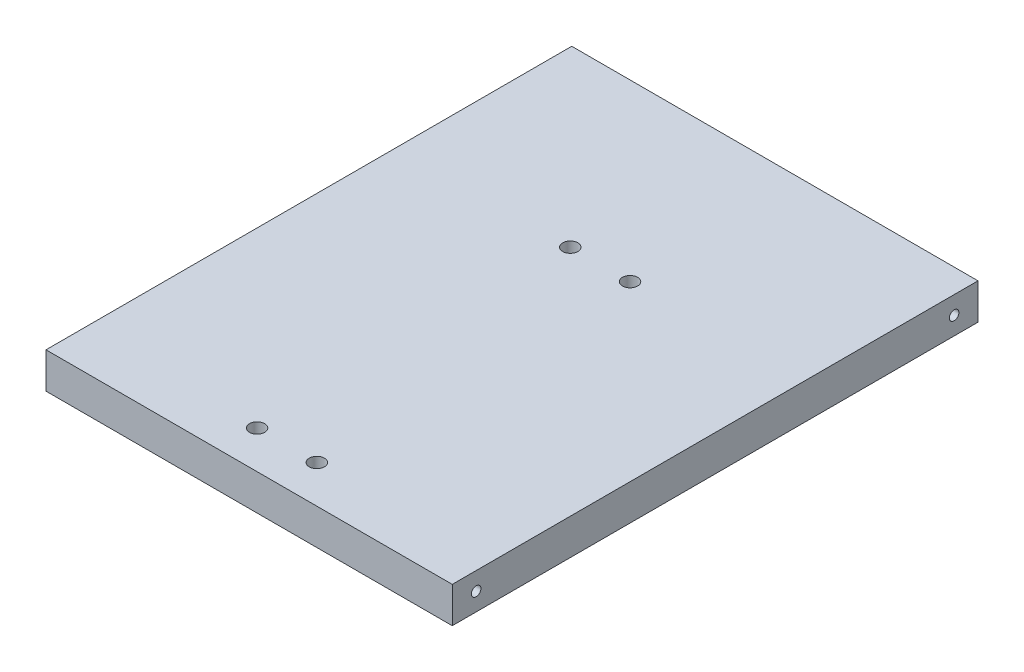
ISO-10303-21;
HEADER;
FILE_DESCRIPTION(('STEP AP214'),'2;1');
FILE_NAME('part.step','',(''),(''),'','','');
FILE_SCHEMA(('AUTOMOTIVE_DESIGN { 1 0 10303 214 1 1 1 1 }'));
ENDSEC;
DATA;
#1=APPLICATION_CONTEXT('core data for automotive mechanical design processes');
#2=APPLICATION_PROTOCOL_DEFINITION('international standard','automotive_design',2000,#1);
#3=PRODUCT_CONTEXT('',#1,'mechanical');
#4=PRODUCT('Part','Part','',(#3));
#5=PRODUCT_RELATED_PRODUCT_CATEGORY('part','',(#4));
#6=PRODUCT_DEFINITION_FORMATION('','',#4);
#7=PRODUCT_DEFINITION_CONTEXT('part definition',#1,'design');
#8=PRODUCT_DEFINITION('design','',#6,#7);
#9=PRODUCT_DEFINITION_SHAPE('','',#8);
#10=(LENGTH_UNIT() NAMED_UNIT(*) SI_UNIT(.MILLI.,.METRE.));
#11=(NAMED_UNIT(*) PLANE_ANGLE_UNIT() SI_UNIT($,.RADIAN.));
#12=(NAMED_UNIT(*) SI_UNIT($,.STERADIAN.) SOLID_ANGLE_UNIT());
#13=UNCERTAINTY_MEASURE_WITH_UNIT(LENGTH_MEASURE(1.E-05),#10,'distance_accuracy_value','');
#14=(GEOMETRIC_REPRESENTATION_CONTEXT(3) GLOBAL_UNCERTAINTY_ASSIGNED_CONTEXT((#13)) GLOBAL_UNIT_ASSIGNED_CONTEXT((#10,
#11,#12)) REPRESENTATION_CONTEXT('',''));
#15=CARTESIAN_POINT('',(0.,0.,0.));
#16=DIRECTION('',(0.,0.,1.));
#17=DIRECTION('',(1.,0.,0.));
#18=AXIS2_PLACEMENT_3D('',#15,#16,#17);
#19=CARTESIAN_POINT('',(0.,15.,0.));
#20=DIRECTION('',(1.,0.,0.));
#21=DIRECTION('',(0.,0.,-1.));
#22=AXIS2_PLACEMENT_3D('',#19,#20,#21);
#23=PLANE('',#22);
#24=CARTESIAN_POINT('',(0.,7.5,-10.));
#25=DIRECTION('',(-1.,0.,0.));
#26=DIRECTION('',(0.,0.,1.));
#27=AXIS2_PLACEMENT_3D('',#24,#25,#26);
#28=CIRCLE('',#27,2.);
#29=CARTESIAN_POINT('',(0.,7.5,-7.99999999999999));
#30=VERTEX_POINT('',#29);
#31=EDGE_CURVE('E117',#30,#30,#28,.T.);
#32=ORIENTED_EDGE('',*,*,#31,.F.);
#33=EDGE_LOOP('',(#32));
#34=FACE_BOUND('',#33,.T.);
#35=CARTESIAN_POINT('',(0.,7.49999999999997,-210.));
#36=DIRECTION('',(-1.,0.,0.));
#37=DIRECTION('',(0.,0.,1.));
#38=AXIS2_PLACEMENT_3D('',#35,#36,#37);
#39=CIRCLE('',#38,2.);
#40=CARTESIAN_POINT('',(0.,7.49999999999997,-208.));
#41=VERTEX_POINT('',#40);
#42=EDGE_CURVE('E110',#41,#41,#39,.T.);
#43=ORIENTED_EDGE('',*,*,#42,.F.);
#44=EDGE_LOOP('',(#43));
#45=FACE_BOUND('',#44,.T.);
#46=DIRECTION('',(0.,0.,1.));
#47=VECTOR('',#46,1.);
#48=CARTESIAN_POINT('',(0.,0.,0.));
#49=LINE('',#48,#47);
#50=CARTESIAN_POINT('',(0.,0.,-220.));
#51=VERTEX_POINT('',#50);
#52=CARTESIAN_POINT('',(0.,0.,0.));
#53=VERTEX_POINT('',#52);
#54=EDGE_CURVE('E96',#51,#53,#49,.T.);
#55=ORIENTED_EDGE('',*,*,#54,.T.);
#56=DIRECTION('',(0.,-1.,0.));
#57=VECTOR('',#56,1.);
#58=CARTESIAN_POINT('',(0.,15.,0.));
#59=LINE('',#58,#57);
#60=CARTESIAN_POINT('',(0.,15.,0.));
#61=VERTEX_POINT('',#60);
#62=EDGE_CURVE('E11',#61,#53,#59,.T.);
#63=ORIENTED_EDGE('',*,*,#62,.F.);
#64=DIRECTION('',(0.,0.,1.));
#65=VECTOR('',#64,1.);
#66=CARTESIAN_POINT('',(0.,15.,0.));
#67=LINE('',#66,#65);
#68=CARTESIAN_POINT('',(0.,15.,-220.));
#69=VERTEX_POINT('',#68);
#70=EDGE_CURVE('E84',#69,#61,#67,.T.);
#71=ORIENTED_EDGE('',*,*,#70,.F.);
#72=DIRECTION('',(0.,-1.,0.));
#73=VECTOR('',#72,1.);
#74=CARTESIAN_POINT('',(0.,15.,-220.));
#75=LINE('',#74,#73);
#76=EDGE_CURVE('E92',#69,#51,#75,.T.);
#77=ORIENTED_EDGE('',*,*,#76,.T.);
#78=EDGE_LOOP('',(#55,#63,#71,#77));
#79=FACE_BOUND('',#78,.T.);
#80=ADVANCED_FACE('F33',(#34,#45,#79),#23,.F.);
#81=CARTESIAN_POINT('',(0.,15.,0.));
#82=DIRECTION('',(0.,0.,-1.));
#83=DIRECTION('',(-1.,0.,0.));
#84=AXIS2_PLACEMENT_3D('',#81,#82,#83);
#85=PLANE('',#84);
#86=DIRECTION('',(1.,0.,0.));
#87=VECTOR('',#86,1.);
#88=CARTESIAN_POINT('',(0.,0.,0.));
#89=LINE('',#88,#87);
#90=CARTESIAN_POINT('',(170.,0.,0.));
#91=VERTEX_POINT('',#90);
#92=EDGE_CURVE('E88',#53,#91,#89,.T.);
#93=ORIENTED_EDGE('',*,*,#92,.T.);
#94=DIRECTION('',(0.,-1.,0.));
#95=VECTOR('',#94,1.);
#96=CARTESIAN_POINT('',(170.,15.,0.));
#97=LINE('',#96,#95);
#98=CARTESIAN_POINT('',(170.,15.,0.));
#99=VERTEX_POINT('',#98);
#100=EDGE_CURVE('E41',#99,#91,#97,.T.);
#101=ORIENTED_EDGE('',*,*,#100,.F.);
#102=DIRECTION('',(1.,0.,0.));
#103=VECTOR('',#102,1.);
#104=CARTESIAN_POINT('',(0.,15.,0.));
#105=LINE('',#104,#103);
#106=EDGE_CURVE('E79',#61,#99,#105,.T.);
#107=ORIENTED_EDGE('',*,*,#106,.F.);
#108=ORIENTED_EDGE('',*,*,#62,.T.);
#109=EDGE_LOOP('',(#93,#101,#107,#108));
#110=FACE_BOUND('',#109,.T.);
#111=ADVANCED_FACE('F87',(#110),#85,.F.);
#112=CARTESIAN_POINT('',(170.,15.,0.));
#113=DIRECTION('',(-1.,0.,0.));
#114=DIRECTION('',(0.,0.,1.));
#115=AXIS2_PLACEMENT_3D('',#112,#113,#114);
#116=PLANE('',#115);
#117=CARTESIAN_POINT('',(170.,7.5,-10.));
#118=DIRECTION('',(-1.,0.,0.));
#119=DIRECTION('',(0.,0.,1.));
#120=AXIS2_PLACEMENT_3D('',#117,#118,#119);
#121=CIRCLE('',#120,2.);
#122=CARTESIAN_POINT('',(170.,7.5,-7.99999999999999));
#123=VERTEX_POINT('',#122);
#124=EDGE_CURVE('E141',#123,#123,#121,.T.);
#125=ORIENTED_EDGE('',*,*,#124,.T.);
#126=EDGE_LOOP('',(#125));
#127=FACE_BOUND('',#126,.T.);
#128=CARTESIAN_POINT('',(170.,7.49999999999997,-210.));
#129=DIRECTION('',(-1.,0.,0.));
#130=DIRECTION('',(0.,0.,1.));
#131=AXIS2_PLACEMENT_3D('',#128,#129,#130);
#132=CIRCLE('',#131,2.);
#133=CARTESIAN_POINT('',(170.,7.49999999999997,-208.));
#134=VERTEX_POINT('',#133);
#135=EDGE_CURVE('E134',#134,#134,#132,.T.);
#136=ORIENTED_EDGE('',*,*,#135,.T.);
#137=EDGE_LOOP('',(#136));
#138=FACE_BOUND('',#137,.T.);
#139=DIRECTION('',(0.,0.,-1.));
#140=VECTOR('',#139,1.);
#141=CARTESIAN_POINT('',(170.,0.,0.));
#142=LINE('',#141,#140);
#143=CARTESIAN_POINT('',(170.,0.,-220.));
#144=VERTEX_POINT('',#143);
#145=EDGE_CURVE('E66',#91,#144,#142,.T.);
#146=ORIENTED_EDGE('',*,*,#145,.T.);
#147=DIRECTION('',(0.,-1.,0.));
#148=VECTOR('',#147,1.);
#149=CARTESIAN_POINT('',(170.,15.,-220.));
#150=LINE('',#149,#148);
#151=CARTESIAN_POINT('',(170.,15.,-220.));
#152=VERTEX_POINT('',#151);
#153=EDGE_CURVE('E89',#152,#144,#150,.T.);
#154=ORIENTED_EDGE('',*,*,#153,.F.);
#155=DIRECTION('',(0.,0.,-1.));
#156=VECTOR('',#155,1.);
#157=CARTESIAN_POINT('',(170.,15.,0.));
#158=LINE('',#157,#156);
#159=EDGE_CURVE('E82',#99,#152,#158,.T.);
#160=ORIENTED_EDGE('',*,*,#159,.F.);
#161=ORIENTED_EDGE('',*,*,#100,.T.);
#162=EDGE_LOOP('',(#146,#154,#160,#161));
#163=FACE_BOUND('',#162,.T.);
#164=ADVANCED_FACE('F90',(#127,#138,#163),#116,.F.);
#165=CARTESIAN_POINT('',(0.,15.,-220.));
#166=DIRECTION('',(0.,0.,1.));
#167=DIRECTION('',(1.,0.,0.));
#168=AXIS2_PLACEMENT_3D('',#165,#166,#167);
#169=PLANE('',#168);
#170=DIRECTION('',(-1.,0.,0.));
#171=VECTOR('',#170,1.);
#172=CARTESIAN_POINT('',(0.,0.,-220.));
#173=LINE('',#172,#171);
#174=EDGE_CURVE('E72',#144,#51,#173,.T.);
#175=ORIENTED_EDGE('',*,*,#174,.T.);
#176=ORIENTED_EDGE('',*,*,#76,.F.);
#177=DIRECTION('',(-1.,0.,0.));
#178=VECTOR('',#177,1.);
#179=CARTESIAN_POINT('',(0.,15.,-220.));
#180=LINE('',#179,#178);
#181=EDGE_CURVE('E49',#152,#69,#180,.T.);
#182=ORIENTED_EDGE('',*,*,#181,.F.);
#183=ORIENTED_EDGE('',*,*,#153,.T.);
#184=EDGE_LOOP('',(#175,#176,#182,#183));
#185=FACE_BOUND('',#184,.T.);
#186=ADVANCED_FACE('F104',(#185),#169,.F.);
#187=CARTESIAN_POINT('',(0.,15.,0.));
#188=DIRECTION('',(0.,-1.,0.));
#189=DIRECTION('',(0.,0.,-1.));
#190=AXIS2_PLACEMENT_3D('',#187,#188,#189);
#191=PLANE('',#190);
#192=CARTESIAN_POINT('',(97.5,15.,-15.821244145017));
#193=DIRECTION('',(0.,-1.,0.));
#194=DIRECTION('',(0.,0.,1.));
#195=AXIS2_PLACEMENT_3D('',#192,#193,#194);
#196=CIRCLE('',#195,3.175);
#197=CARTESIAN_POINT('',(97.5,15.,-12.646244145017));
#198=VERTEX_POINT('',#197);
#199=EDGE_CURVE('E149',#198,#198,#196,.T.);
#200=ORIENTED_EDGE('',*,*,#199,.T.);
#201=EDGE_LOOP('',(#200));
#202=FACE_BOUND('',#201,.T.);
#203=CARTESIAN_POINT('',(97.5,15.,-146.891244145017));
#204=DIRECTION('',(0.,-1.,0.));
#205=DIRECTION('',(0.,0.,1.));
#206=AXIS2_PLACEMENT_3D('',#203,#204,#205);
#207=CIRCLE('',#206,3.175);
#208=CARTESIAN_POINT('',(97.5,15.,-143.716244145017));
#209=VERTEX_POINT('',#208);
#210=EDGE_CURVE('E150',#209,#209,#207,.T.);
#211=ORIENTED_EDGE('',*,*,#210,.T.);
#212=EDGE_LOOP('',(#211));
#213=FACE_BOUND('',#212,.T.);
#214=CARTESIAN_POINT('',(72.5,15.,-15.821244145017));
#215=DIRECTION('',(0.,1.,0.));
#216=DIRECTION('',(0.,0.,1.));
#217=AXIS2_PLACEMENT_3D('',#214,#215,#216);
#218=CIRCLE('',#217,3.175);
#219=CARTESIAN_POINT('',(72.5,15.,-12.646244145017));
#220=VERTEX_POINT('',#219);
#221=EDGE_CURVE('E125',#220,#220,#218,.T.);
#222=ORIENTED_EDGE('',*,*,#221,.F.);
#223=EDGE_LOOP('',(#222));
#224=FACE_BOUND('',#223,.T.);
#225=CARTESIAN_POINT('',(72.5,15.,-146.891244145017));
#226=DIRECTION('',(0.,1.,0.));
#227=DIRECTION('',(0.,0.,1.));
#228=AXIS2_PLACEMENT_3D('',#225,#226,#227);
#229=CIRCLE('',#228,3.175);
#230=CARTESIAN_POINT('',(72.5,15.,-143.716244145017));
#231=VERTEX_POINT('',#230);
#232=EDGE_CURVE('E126',#231,#231,#229,.T.);
#233=ORIENTED_EDGE('',*,*,#232,.F.);
#234=EDGE_LOOP('',(#233));
#235=FACE_BOUND('',#234,.T.);
#236=ORIENTED_EDGE('',*,*,#70,.T.);
#237=ORIENTED_EDGE('',*,*,#106,.T.);
#238=ORIENTED_EDGE('',*,*,#159,.T.);
#239=ORIENTED_EDGE('',*,*,#181,.T.);
#240=EDGE_LOOP('',(#236,#237,#238,#239));
#241=FACE_BOUND('',#240,.T.);
#242=ADVANCED_FACE('F80',(#202,#213,#224,#235,#241),#191,.F.);
#243=CARTESIAN_POINT('',(0.,0.,0.));
#244=DIRECTION('',(0.,-1.,0.));
#245=DIRECTION('',(0.,0.,-1.));
#246=AXIS2_PLACEMENT_3D('',#243,#244,#245);
#247=PLANE('',#246);
#248=CARTESIAN_POINT('',(97.5,0.,-15.821244145017));
#249=DIRECTION('',(0.,-1.,0.));
#250=DIRECTION('',(0.,0.,-1.));
#251=AXIS2_PLACEMENT_3D('',#248,#249,#250);
#252=CIRCLE('',#251,3.175);
#253=CARTESIAN_POINT('',(97.5,0.,-18.996244145017));
#254=VERTEX_POINT('',#253);
#255=EDGE_CURVE('E138',#254,#254,#252,.T.);
#256=ORIENTED_EDGE('',*,*,#255,.F.);
#257=EDGE_LOOP('',(#256));
#258=FACE_BOUND('',#257,.T.);
#259=CARTESIAN_POINT('',(97.5,0.,-146.891244145017));
#260=DIRECTION('',(0.,-1.,0.));
#261=DIRECTION('',(0.,0.,-1.));
#262=AXIS2_PLACEMENT_3D('',#259,#260,#261);
#263=CIRCLE('',#262,3.175);
#264=CARTESIAN_POINT('',(97.5,0.,-150.066244145017));
#265=VERTEX_POINT('',#264);
#266=EDGE_CURVE('E146',#265,#265,#263,.T.);
#267=ORIENTED_EDGE('',*,*,#266,.F.);
#268=EDGE_LOOP('',(#267));
#269=FACE_BOUND('',#268,.T.);
#270=CARTESIAN_POINT('',(72.5,0.,-15.821244145017));
#271=DIRECTION('',(0.,-1.,0.));
#272=DIRECTION('',(0.,0.,-1.));
#273=AXIS2_PLACEMENT_3D('',#270,#271,#272);
#274=CIRCLE('',#273,3.175);
#275=CARTESIAN_POINT('',(72.5,0.,-18.996244145017));
#276=VERTEX_POINT('',#275);
#277=EDGE_CURVE('E114',#276,#276,#274,.F.);
#278=ORIENTED_EDGE('',*,*,#277,.T.);
#279=EDGE_LOOP('',(#278));
#280=FACE_BOUND('',#279,.T.);
#281=CARTESIAN_POINT('',(72.5,0.,-146.891244145017));
#282=DIRECTION('',(0.,-1.,0.));
#283=DIRECTION('',(0.,0.,-1.));
#284=AXIS2_PLACEMENT_3D('',#281,#282,#283);
#285=CIRCLE('',#284,3.175);
#286=CARTESIAN_POINT('',(72.5,0.,-150.066244145017));
#287=VERTEX_POINT('',#286);
#288=EDGE_CURVE('E122',#287,#287,#285,.F.);
#289=ORIENTED_EDGE('',*,*,#288,.T.);
#290=EDGE_LOOP('',(#289));
#291=FACE_BOUND('',#290,.T.);
#292=ORIENTED_EDGE('',*,*,#54,.F.);
#293=ORIENTED_EDGE('',*,*,#174,.F.);
#294=ORIENTED_EDGE('',*,*,#145,.F.);
#295=ORIENTED_EDGE('',*,*,#92,.F.);
#296=EDGE_LOOP('',(#292,#293,#294,#295));
#297=FACE_BOUND('',#296,.T.);
#298=ADVANCED_FACE('F107',(#258,#269,#280,#291,#297),#247,.T.);
#299=CARTESIAN_POINT('',(20.,7.49999999999997,-210.));
#300=DIRECTION('',(-1.,0.,0.));
#301=DIRECTION('',(0.,0.,1.));
#302=AXIS2_PLACEMENT_3D('',#299,#300,#301);
#303=CYLINDRICAL_SURFACE('',#302,2.);
#304=CARTESIAN_POINT('',(20.,7.49999999999997,-210.));
#305=DIRECTION('',(-1.,0.,0.));
#306=DIRECTION('',(0.,0.,1.));
#307=AXIS2_PLACEMENT_3D('',#304,#305,#306);
#308=CIRCLE('',#307,2.);
#309=CARTESIAN_POINT('',(20.,7.49999999999997,-208.));
#310=VERTEX_POINT('',#309);
#311=EDGE_CURVE('E113',#310,#310,#308,.T.);
#312=ORIENTED_EDGE('',*,*,#311,.F.);
#313=EDGE_LOOP('',(#312));
#314=FACE_BOUND('',#313,.T.);
#315=ORIENTED_EDGE('',*,*,#42,.T.);
#316=EDGE_LOOP('',(#315));
#317=FACE_BOUND('',#316,.T.);
#318=ADVANCED_FACE('F169',(#314,#317),#303,.F.);
#319=CARTESIAN_POINT('',(20.,7.49999999999997,-210.));
#320=DIRECTION('',(-1.,0.,0.));
#321=DIRECTION('',(0.,0.,1.));
#322=AXIS2_PLACEMENT_3D('',#319,#320,#321);
#323=PLANE('',#322);
#324=ORIENTED_EDGE('',*,*,#311,.T.);
#325=EDGE_LOOP('',(#324));
#326=FACE_BOUND('',#325,.T.);
#327=ADVANCED_FACE('F203',(#326),#323,.T.);
#328=CARTESIAN_POINT('',(20.,7.5,-10.));
#329=DIRECTION('',(-1.,0.,0.));
#330=DIRECTION('',(0.,0.,1.));
#331=AXIS2_PLACEMENT_3D('',#328,#329,#330);
#332=CYLINDRICAL_SURFACE('',#331,2.);
#333=CARTESIAN_POINT('',(20.,7.5,-10.));
#334=DIRECTION('',(-1.,0.,0.));
#335=DIRECTION('',(0.,0.,1.));
#336=AXIS2_PLACEMENT_3D('',#333,#334,#335);
#337=CIRCLE('',#336,2.);
#338=CARTESIAN_POINT('',(20.,7.5,-7.99999999999999));
#339=VERTEX_POINT('',#338);
#340=EDGE_CURVE('E99',#339,#339,#337,.T.);
#341=ORIENTED_EDGE('',*,*,#340,.F.);
#342=EDGE_LOOP('',(#341));
#343=FACE_BOUND('',#342,.T.);
#344=ORIENTED_EDGE('',*,*,#31,.T.);
#345=EDGE_LOOP('',(#344));
#346=FACE_BOUND('',#345,.T.);
#347=ADVANCED_FACE('F190',(#343,#346),#332,.F.);
#348=CARTESIAN_POINT('',(20.,7.5,-10.));
#349=DIRECTION('',(-1.,0.,0.));
#350=DIRECTION('',(0.,0.,1.));
#351=AXIS2_PLACEMENT_3D('',#348,#349,#350);
#352=PLANE('',#351);
#353=ORIENTED_EDGE('',*,*,#340,.T.);
#354=EDGE_LOOP('',(#353));
#355=FACE_BOUND('',#354,.T.);
#356=ADVANCED_FACE('F180',(#355),#352,.T.);
#357=CARTESIAN_POINT('',(72.5,-8.98025612106917,-146.891244145017));
#358=DIRECTION('',(0.,1.,0.));
#359=DIRECTION('',(0.,0.,1.));
#360=AXIS2_PLACEMENT_3D('',#357,#358,#359);
#361=CYLINDRICAL_SURFACE('',#360,3.175);
#362=ORIENTED_EDGE('',*,*,#232,.T.);
#363=EDGE_LOOP('',(#362));
#364=FACE_BOUND('',#363,.T.);
#365=ORIENTED_EDGE('',*,*,#288,.F.);
#366=EDGE_LOOP('',(#365));
#367=FACE_BOUND('',#366,.T.);
#368=ADVANCED_FACE('F177',(#364,#367),#361,.F.);
#369=CARTESIAN_POINT('',(72.5,-8.98025612106917,-15.821244145017));
#370=DIRECTION('',(0.,1.,0.));
#371=DIRECTION('',(0.,0.,1.));
#372=AXIS2_PLACEMENT_3D('',#369,#370,#371);
#373=CYLINDRICAL_SURFACE('',#372,3.175);
#374=ORIENTED_EDGE('',*,*,#221,.T.);
#375=EDGE_LOOP('',(#374));
#376=FACE_BOUND('',#375,.T.);
#377=ORIENTED_EDGE('',*,*,#277,.F.);
#378=EDGE_LOOP('',(#377));
#379=FACE_BOUND('',#378,.T.);
#380=ADVANCED_FACE('F179',(#376,#379),#373,.F.);
#381=CARTESIAN_POINT('',(150.,7.49999999999997,-210.));
#382=DIRECTION('',(1.,0.,0.));
#383=DIRECTION('',(0.,0.,-1.));
#384=AXIS2_PLACEMENT_3D('',#381,#382,#383);
#385=CYLINDRICAL_SURFACE('',#384,2.);
#386=CARTESIAN_POINT('',(150.,7.49999999999997,-210.));
#387=DIRECTION('',(-1.,0.,0.));
#388=DIRECTION('',(0.,0.,1.));
#389=AXIS2_PLACEMENT_3D('',#386,#387,#388);
#390=CIRCLE('',#389,2.);
#391=CARTESIAN_POINT('',(150.,7.49999999999997,-208.));
#392=VERTEX_POINT('',#391);
#393=EDGE_CURVE('E137',#392,#392,#390,.T.);
#394=ORIENTED_EDGE('',*,*,#393,.T.);
#395=EDGE_LOOP('',(#394));
#396=FACE_BOUND('',#395,.T.);
#397=ORIENTED_EDGE('',*,*,#135,.F.);
#398=EDGE_LOOP('',(#397));
#399=FACE_BOUND('',#398,.T.);
#400=ADVANCED_FACE('F187',(#396,#399),#385,.F.);
#401=CARTESIAN_POINT('',(150.,7.49999999999997,-210.));
#402=DIRECTION('',(1.,0.,0.));
#403=DIRECTION('',(0.,0.,1.));
#404=AXIS2_PLACEMENT_3D('',#401,#402,#403);
#405=PLANE('',#404);
#406=ORIENTED_EDGE('',*,*,#393,.F.);
#407=EDGE_LOOP('',(#406));
#408=FACE_BOUND('',#407,.T.);
#409=ADVANCED_FACE('F227',(#408),#405,.T.);
#410=CARTESIAN_POINT('',(150.,7.5,-10.));
#411=DIRECTION('',(1.,0.,0.));
#412=DIRECTION('',(0.,0.,-1.));
#413=AXIS2_PLACEMENT_3D('',#410,#411,#412);
#414=CYLINDRICAL_SURFACE('',#413,2.);
#415=CARTESIAN_POINT('',(150.,7.5,-10.));
#416=DIRECTION('',(-1.,0.,0.));
#417=DIRECTION('',(0.,0.,1.));
#418=AXIS2_PLACEMENT_3D('',#415,#416,#417);
#419=CIRCLE('',#418,2.);
#420=CARTESIAN_POINT('',(150.,7.5,-7.99999999999999));
#421=VERTEX_POINT('',#420);
#422=EDGE_CURVE('E129',#421,#421,#419,.T.);
#423=ORIENTED_EDGE('',*,*,#422,.T.);
#424=EDGE_LOOP('',(#423));
#425=FACE_BOUND('',#424,.T.);
#426=ORIENTED_EDGE('',*,*,#124,.F.);
#427=EDGE_LOOP('',(#426));
#428=FACE_BOUND('',#427,.T.);
#429=ADVANCED_FACE('F233',(#425,#428),#414,.F.);
#430=CARTESIAN_POINT('',(150.,7.5,-10.));
#431=DIRECTION('',(1.,0.,0.));
#432=DIRECTION('',(0.,0.,1.));
#433=AXIS2_PLACEMENT_3D('',#430,#431,#432);
#434=PLANE('',#433);
#435=ORIENTED_EDGE('',*,*,#422,.F.);
#436=EDGE_LOOP('',(#435));
#437=FACE_BOUND('',#436,.T.);
#438=ADVANCED_FACE('F239',(#437),#434,.T.);
#439=CARTESIAN_POINT('',(97.5,-8.98025612106917,-146.891244145017));
#440=DIRECTION('',(0.,1.,0.));
#441=DIRECTION('',(0.,0.,1.));
#442=AXIS2_PLACEMENT_3D('',#439,#440,#441);
#443=CYLINDRICAL_SURFACE('',#442,3.175);
#444=ORIENTED_EDGE('',*,*,#210,.F.);
#445=EDGE_LOOP('',(#444));
#446=FACE_BOUND('',#445,.T.);
#447=ORIENTED_EDGE('',*,*,#266,.T.);
#448=EDGE_LOOP('',(#447));
#449=FACE_BOUND('',#448,.T.);
#450=ADVANCED_FACE('F163',(#446,#449),#443,.F.);
#451=CARTESIAN_POINT('',(97.5,-8.98025612106917,-15.821244145017));
#452=DIRECTION('',(0.,1.,0.));
#453=DIRECTION('',(0.,0.,1.));
#454=AXIS2_PLACEMENT_3D('',#451,#452,#453);
#455=CYLINDRICAL_SURFACE('',#454,3.175);
#456=ORIENTED_EDGE('',*,*,#199,.F.);
#457=EDGE_LOOP('',(#456));
#458=FACE_BOUND('',#457,.T.);
#459=ORIENTED_EDGE('',*,*,#255,.T.);
#460=EDGE_LOOP('',(#459));
#461=FACE_BOUND('',#460,.T.);
#462=ADVANCED_FACE('F160',(#458,#461),#455,.F.);
#463=CLOSED_SHELL('',(#80,#111,#164,#186,#242,#298,#318,#327,#347,#356,#368,#380,#400,#409,#429,
#438,#450,#462));
#464=MANIFOLD_SOLID_BREP('B2',#463);
#465=ADVANCED_BREP_SHAPE_REPRESENTATION('',(#18,#464),#14);
#466=SHAPE_DEFINITION_REPRESENTATION(#9,#465);
ENDSEC;
END-ISO-10303-21;
